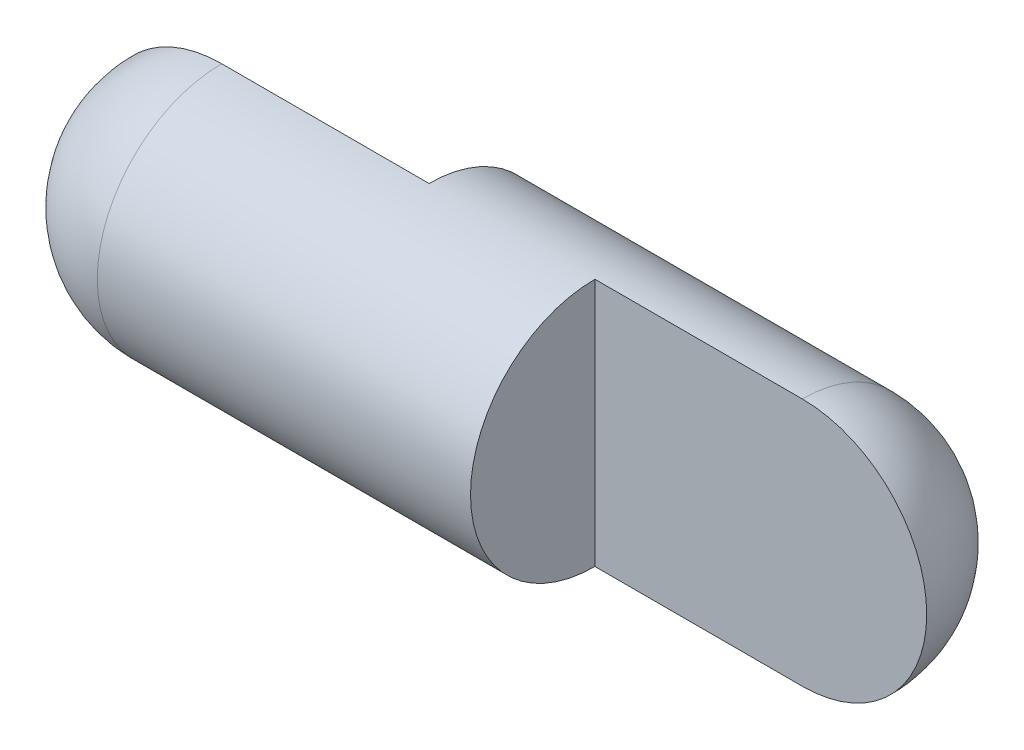
ISO-10303-21;
HEADER;
FILE_DESCRIPTION(('STEP AP214'),'2;1');
FILE_NAME('part.step','',(''),(''),'','','');
FILE_SCHEMA(('AUTOMOTIVE_DESIGN { 1 0 10303 214 1 1 1 1 }'));
ENDSEC;
DATA;
#1=APPLICATION_CONTEXT('core data for automotive mechanical design processes');
#2=APPLICATION_PROTOCOL_DEFINITION('international standard','automotive_design',2000,#1);
#3=PRODUCT_CONTEXT('',#1,'mechanical');
#4=PRODUCT('Part','Part','',(#3));
#5=PRODUCT_RELATED_PRODUCT_CATEGORY('part','',(#4));
#6=PRODUCT_DEFINITION_FORMATION('','',#4);
#7=PRODUCT_DEFINITION_CONTEXT('part definition',#1,'design');
#8=PRODUCT_DEFINITION('design','',#6,#7);
#9=PRODUCT_DEFINITION_SHAPE('','',#8);
#10=(LENGTH_UNIT() NAMED_UNIT(*) SI_UNIT(.MILLI.,.METRE.));
#11=(NAMED_UNIT(*) PLANE_ANGLE_UNIT() SI_UNIT($,.RADIAN.));
#12=(NAMED_UNIT(*) SI_UNIT($,.STERADIAN.) SOLID_ANGLE_UNIT());
#13=UNCERTAINTY_MEASURE_WITH_UNIT(LENGTH_MEASURE(1.E-05),#10,'distance_accuracy_value','');
#14=(GEOMETRIC_REPRESENTATION_CONTEXT(3) GLOBAL_UNCERTAINTY_ASSIGNED_CONTEXT((#13)) GLOBAL_UNIT_ASSIGNED_CONTEXT((#10,
#11,#12)) REPRESENTATION_CONTEXT('',''));
#15=CARTESIAN_POINT('',(0.,0.,0.));
#16=DIRECTION('',(0.,0.,1.));
#17=DIRECTION('',(1.,0.,0.));
#18=AXIS2_PLACEMENT_3D('',#15,#16,#17);
#19=CARTESIAN_POINT('',(0.,0.,0.));
#20=DIRECTION('',(-1.,0.,0.));
#21=DIRECTION('',(0.,-1.,0.));
#22=AXIS2_PLACEMENT_3D('',#19,#20,#21);
#23=SPHERICAL_SURFACE('',#22,75.);
#24=CARTESIAN_POINT('',(0.,0.,0.));
#25=DIRECTION('',(-1.,0.,0.));
#26=DIRECTION('',(0.,0.,1.));
#27=AXIS2_PLACEMENT_3D('',#24,#25,#26);
#28=CIRCLE('',#27,75.);
#29=CARTESIAN_POINT('',(0.,-75.,-5.2372220082647E-13));
#30=VERTEX_POINT('',#29);
#31=CARTESIAN_POINT('',(0.,75.,0.));
#32=VERTEX_POINT('',#31);
#33=EDGE_CURVE('E46',#30,#32,#28,.T.);
#34=ORIENTED_EDGE('',*,*,#33,.T.);
#35=CARTESIAN_POINT('',(0.,0.,0.));
#36=DIRECTION('',(0.,0.,-1.));
#37=DIRECTION('',(1.,0.,0.));
#38=AXIS2_PLACEMENT_3D('',#35,#36,#37);
#39=CIRCLE('',#38,75.);
#40=EDGE_CURVE('E100',#30,#32,#39,.T.);
#41=ORIENTED_EDGE('',*,*,#40,.F.);
#42=EDGE_LOOP('',(#34,#41));
#43=FACE_BOUND('',#42,.T.);
#44=ADVANCED_FACE('F38',(#43),#23,.T.);
#45=CARTESIAN_POINT('',(225.,0.,0.));
#46=DIRECTION('',(-1.,0.,0.));
#47=DIRECTION('',(0.,0.,1.));
#48=AXIS2_PLACEMENT_3D('',#45,#46,#47);
#49=PLANE('',#48);
#50=CARTESIAN_POINT('',(225.,0.,0.));
#51=DIRECTION('',(-1.,0.,0.));
#52=DIRECTION('',(0.,0.,1.));
#53=AXIS2_PLACEMENT_3D('',#50,#51,#52);
#54=CIRCLE('',#53,75.);
#55=CARTESIAN_POINT('',(225.,-75.,-5.2372220082647E-13));
#56=VERTEX_POINT('',#55);
#57=CARTESIAN_POINT('',(225.,75.,0.));
#58=VERTEX_POINT('',#57);
#59=EDGE_CURVE('E11',#56,#58,#54,.T.);
#60=ORIENTED_EDGE('',*,*,#59,.F.);
#61=DIRECTION('',(0.,-1.,0.));
#62=VECTOR('',#61,1.);
#63=CARTESIAN_POINT('',(225.,0.,0.));
#64=LINE('',#63,#62);
#65=EDGE_CURVE('E86',#58,#56,#64,.T.);
#66=ORIENTED_EDGE('',*,*,#65,.F.);
#67=EDGE_LOOP('',(#60,#66));
#68=FACE_BOUND('',#67,.T.);
#69=ADVANCED_FACE('F40',(#68),#49,.F.);
#70=CARTESIAN_POINT('',(-97.7960834288232,0.,0.));
#71=DIRECTION('',(-1.,0.,0.));
#72=DIRECTION('',(0.,0.,1.));
#73=AXIS2_PLACEMENT_3D('',#70,#71,#72);
#74=CYLINDRICAL_SURFACE('',#73,75.);
#75=DIRECTION('',(1.,0.,0.));
#76=VECTOR('',#75,1.);
#77=CARTESIAN_POINT('',(0.,-75.,0.));
#78=LINE('',#77,#76);
#79=CARTESIAN_POINT('',(350.,-75.,0.));
#80=VERTEX_POINT('',#79);
#81=EDGE_CURVE('E81',#56,#80,#78,.T.);
#82=ORIENTED_EDGE('',*,*,#81,.F.);
#83=ORIENTED_EDGE('',*,*,#59,.T.);
#84=DIRECTION('',(1.,0.,0.));
#85=VECTOR('',#84,1.);
#86=CARTESIAN_POINT('',(0.,75.,5.2372220082647E-13));
#87=LINE('',#86,#85);
#88=CARTESIAN_POINT('',(350.,75.,5.2372220082647E-13));
#89=VERTEX_POINT('',#88);
#90=EDGE_CURVE('E89',#58,#89,#87,.T.);
#91=ORIENTED_EDGE('',*,*,#90,.T.);
#92=CARTESIAN_POINT('',(350.,0.,0.));
#93=DIRECTION('',(-1.,0.,0.));
#94=DIRECTION('',(0.,0.,1.));
#95=AXIS2_PLACEMENT_3D('',#92,#93,#94);
#96=CIRCLE('',#95,75.);
#97=EDGE_CURVE('E94',#89,#80,#96,.T.);
#98=ORIENTED_EDGE('',*,*,#97,.T.);
#99=EDGE_LOOP('',(#82,#83,#91,#98));
#100=FACE_BOUND('',#99,.T.);
#101=DIRECTION('',(1.,0.,0.));
#102=VECTOR('',#101,1.);
#103=CARTESIAN_POINT('',(0.,-75.,-5.2372220082647E-13));
#104=LINE('',#103,#102);
#105=CARTESIAN_POINT('',(125.,-75.,-5.2372220082647E-13));
#106=VERTEX_POINT('',#105);
#107=EDGE_CURVE('E108',#30,#106,#104,.T.);
#108=ORIENTED_EDGE('',*,*,#107,.T.);
#109=CARTESIAN_POINT('',(125.,0.,0.));
#110=DIRECTION('',(-1.,0.,0.));
#111=DIRECTION('',(0.,0.,1.));
#112=AXIS2_PLACEMENT_3D('',#109,#110,#111);
#113=CIRCLE('',#112,75.);
#114=CARTESIAN_POINT('',(125.,75.,5.2372220082647E-13));
#115=VERTEX_POINT('',#114);
#116=EDGE_CURVE('E98',#115,#106,#113,.T.);
#117=ORIENTED_EDGE('',*,*,#116,.F.);
#118=DIRECTION('',(1.,0.,0.));
#119=VECTOR('',#118,1.);
#120=CARTESIAN_POINT('',(0.,75.,0.));
#121=LINE('',#120,#119);
#122=EDGE_CURVE('E97',#32,#115,#121,.T.);
#123=ORIENTED_EDGE('',*,*,#122,.F.);
#124=ORIENTED_EDGE('',*,*,#33,.F.);
#125=EDGE_LOOP('',(#108,#117,#123,#124));
#126=FACE_BOUND('',#125,.T.);
#127=ADVANCED_FACE('F96',(#100,#126),#74,.T.);
#128=CARTESIAN_POINT('',(0.,0.,0.));
#129=DIRECTION('',(0.,0.,-1.));
#130=DIRECTION('',(1.,0.,0.));
#131=AXIS2_PLACEMENT_3D('',#128,#129,#130);
#132=PLANE('',#131);
#133=DIRECTION('',(0.,1.,0.));
#134=VECTOR('',#133,1.);
#135=CARTESIAN_POINT('',(125.,0.,0.));
#136=LINE('',#135,#134);
#137=EDGE_CURVE('E53',#106,#115,#136,.T.);
#138=ORIENTED_EDGE('',*,*,#137,.F.);
#139=ORIENTED_EDGE('',*,*,#107,.F.);
#140=ORIENTED_EDGE('',*,*,#40,.T.);
#141=ORIENTED_EDGE('',*,*,#122,.T.);
#142=EDGE_LOOP('',(#138,#139,#140,#141));
#143=FACE_BOUND('',#142,.T.);
#144=ADVANCED_FACE('F111',(#143),#132,.T.);
#145=CARTESIAN_POINT('',(0.,0.,0.));
#146=DIRECTION('',(0.,0.,-1.));
#147=DIRECTION('',(1.,0.,0.));
#148=AXIS2_PLACEMENT_3D('',#145,#146,#147);
#149=PLANE('',#148);
#150=ORIENTED_EDGE('',*,*,#90,.F.);
#151=ORIENTED_EDGE('',*,*,#65,.T.);
#152=ORIENTED_EDGE('',*,*,#81,.T.);
#153=CARTESIAN_POINT('',(350.,0.,0.));
#154=DIRECTION('',(0.,0.,-1.));
#155=DIRECTION('',(1.,0.,0.));
#156=AXIS2_PLACEMENT_3D('',#153,#154,#155);
#157=CIRCLE('',#156,75.0000000000001);
#158=EDGE_CURVE('E85',#89,#80,#157,.T.);
#159=ORIENTED_EDGE('',*,*,#158,.F.);
#160=EDGE_LOOP('',(#150,#151,#152,#159));
#161=FACE_BOUND('',#160,.T.);
#162=ADVANCED_FACE('F84',(#161),#149,.F.);
#163=CARTESIAN_POINT('',(350.,0.,0.));
#164=DIRECTION('',(-1.,0.,0.));
#165=DIRECTION('',(0.,1.,0.));
#166=AXIS2_PLACEMENT_3D('',#163,#164,#165);
#167=SPHERICAL_SURFACE('',#166,75.0000000000001);
#168=ORIENTED_EDGE('',*,*,#158,.T.);
#169=ORIENTED_EDGE('',*,*,#97,.F.);
#170=EDGE_LOOP('',(#168,#169));
#171=FACE_BOUND('',#170,.T.);
#172=ADVANCED_FACE('F93',(#171),#167,.T.);
#173=CARTESIAN_POINT('',(125.,0.,0.));
#174=DIRECTION('',(-1.,0.,0.));
#175=DIRECTION('',(0.,0.,1.));
#176=AXIS2_PLACEMENT_3D('',#173,#174,#175);
#177=PLANE('',#176);
#178=ORIENTED_EDGE('',*,*,#137,.T.);
#179=ORIENTED_EDGE('',*,*,#116,.T.);
#180=EDGE_LOOP('',(#178,#179));
#181=FACE_BOUND('',#180,.T.);
#182=ADVANCED_FACE('F113',(#181),#177,.T.);
#183=CLOSED_SHELL('',(#44,#69,#127,#144,#162,#172,#182));
#184=MANIFOLD_SOLID_BREP('B2',#183);
#185=ADVANCED_BREP_SHAPE_REPRESENTATION('',(#18,#184),#14);
#186=SHAPE_DEFINITION_REPRESENTATION(#9,#185);
ENDSEC;
END-ISO-10303-21;
